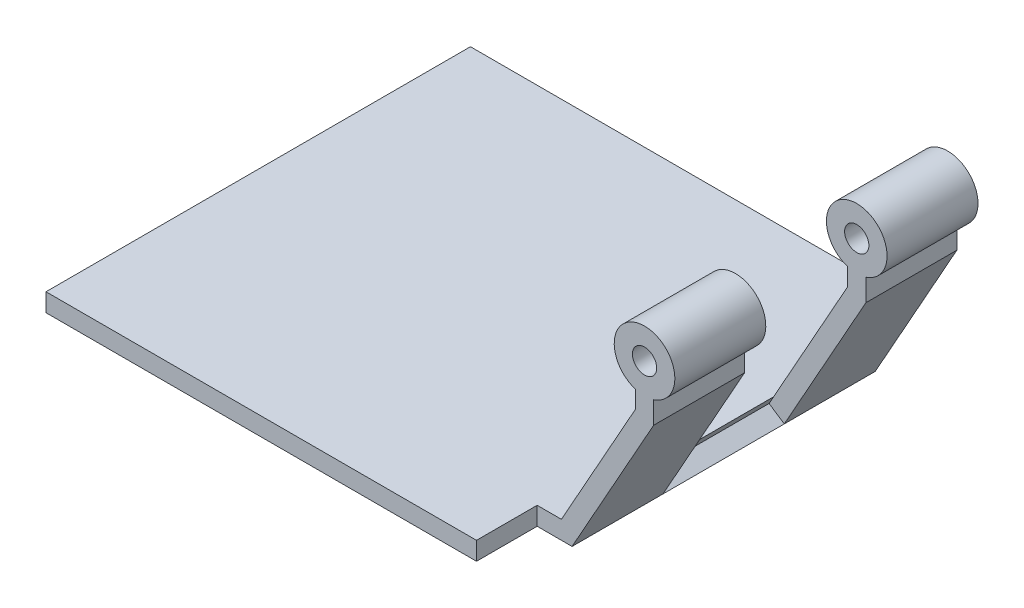
ISO-10303-21;
HEADER;
FILE_DESCRIPTION(('STEP AP214'),'2;1');
FILE_NAME('part.step','',(''),(''),'','','');
FILE_SCHEMA(('AUTOMOTIVE_DESIGN { 1 0 10303 214 1 1 1 1 }'));
ENDSEC;
DATA;
#1=APPLICATION_CONTEXT('core data for automotive mechanical design processes');
#2=APPLICATION_PROTOCOL_DEFINITION('international standard','automotive_design',2000,#1);
#3=PRODUCT_CONTEXT('',#1,'mechanical');
#4=PRODUCT('Part','Part','',(#3));
#5=PRODUCT_RELATED_PRODUCT_CATEGORY('part','',(#4));
#6=PRODUCT_DEFINITION_FORMATION('','',#4);
#7=PRODUCT_DEFINITION_CONTEXT('part definition',#1,'design');
#8=PRODUCT_DEFINITION('design','',#6,#7);
#9=PRODUCT_DEFINITION_SHAPE('','',#8);
#10=(LENGTH_UNIT() NAMED_UNIT(*) SI_UNIT(.MILLI.,.METRE.));
#11=(NAMED_UNIT(*) PLANE_ANGLE_UNIT() SI_UNIT($,.RADIAN.));
#12=(NAMED_UNIT(*) SI_UNIT($,.STERADIAN.) SOLID_ANGLE_UNIT());
#13=UNCERTAINTY_MEASURE_WITH_UNIT(LENGTH_MEASURE(1.E-05),#10,'distance_accuracy_value','');
#14=(GEOMETRIC_REPRESENTATION_CONTEXT(3) GLOBAL_UNCERTAINTY_ASSIGNED_CONTEXT((#13)) GLOBAL_UNIT_ASSIGNED_CONTEXT((#10,
#11,#12)) REPRESENTATION_CONTEXT('',''));
#15=CARTESIAN_POINT('',(0.,0.,0.));
#16=DIRECTION('',(0.,0.,1.));
#17=DIRECTION('',(1.,0.,0.));
#18=AXIS2_PLACEMENT_3D('',#15,#16,#17);
#19=CARTESIAN_POINT('',(93.710751130021,32.4608617941307,50.));
#20=DIRECTION('',(0.,0.,-1.));
#21=DIRECTION('',(-1.,0.,0.));
#22=AXIS2_PLACEMENT_3D('',#19,#20,#21);
#23=CYLINDRICAL_SURFACE('',#22,5.00000000000001);
#24=CARTESIAN_POINT('',(93.710751130021,32.4608617941307,15.));
#25=DIRECTION('',(0.,0.,1.));
#26=DIRECTION('',(0.,-1.,0.));
#27=AXIS2_PLACEMENT_3D('',#24,#25,#26);
#28=CIRCLE('',#27,5.00000000000001);
#29=CARTESIAN_POINT('',(95.210751130021,27.6911657870459,15.));
#30=VERTEX_POINT('',#29);
#31=CARTESIAN_POINT('',(92.210751130021,27.6911657870459,15.));
#32=VERTEX_POINT('',#31);
#33=EDGE_CURVE('E246',#30,#32,#28,.T.);
#34=ORIENTED_EDGE('',*,*,#33,.F.);
#35=DIRECTION('',(0.,0.,-1.));
#36=VECTOR('',#35,1.);
#37=CARTESIAN_POINT('',(95.210751130021,27.6911657870459,50.));
#38=LINE('',#37,#36);
#39=CARTESIAN_POINT('',(95.210751130021,27.6911657870459,0.));
#40=VERTEX_POINT('',#39);
#41=EDGE_CURVE('E335',#30,#40,#38,.T.);
#42=ORIENTED_EDGE('',*,*,#41,.T.);
#43=CARTESIAN_POINT('',(93.710751130021,32.4608617941307,0.));
#44=DIRECTION('',(0.,0.,1.));
#45=DIRECTION('',(1.,0.,0.));
#46=AXIS2_PLACEMENT_3D('',#43,#44,#45);
#47=CIRCLE('',#46,5.00000000000001);
#48=CARTESIAN_POINT('',(92.210751130021,27.6911657870459,0.));
#49=VERTEX_POINT('',#48);
#50=EDGE_CURVE('E276',#40,#49,#47,.T.);
#51=ORIENTED_EDGE('',*,*,#50,.T.);
#52=DIRECTION('',(0.,0.,-1.));
#53=VECTOR('',#52,1.);
#54=CARTESIAN_POINT('',(92.210751130021,27.6911657870459,50.));
#55=LINE('',#54,#53);
#56=EDGE_CURVE('E326',#32,#49,#55,.T.);
#57=ORIENTED_EDGE('',*,*,#56,.F.);
#58=EDGE_LOOP('',(#34,#42,#51,#57));
#59=FACE_BOUND('',#58,.T.);
#60=ADVANCED_FACE('F60',(#59),#23,.T.);
#61=CARTESIAN_POINT('',(93.710751130021,32.4608617941307,35.));
#62=DIRECTION('',(0.,0.,-1.));
#63=DIRECTION('',(0.,1.,0.));
#64=AXIS2_PLACEMENT_3D('',#61,#62,#63);
#65=CIRCLE('',#64,5.00000000000001);
#66=CARTESIAN_POINT('',(92.210751130021,27.6911657870459,35.));
#67=VERTEX_POINT('',#66);
#68=CARTESIAN_POINT('',(95.210751130021,27.6911657870459,35.));
#69=VERTEX_POINT('',#68);
#70=EDGE_CURVE('E260',#67,#69,#65,.T.);
#71=ORIENTED_EDGE('',*,*,#70,.F.);
#72=CARTESIAN_POINT('',(92.210751130021,27.6911657870459,50.));
#73=VERTEX_POINT('',#72);
#74=EDGE_CURVE('E332',#73,#67,#55,.T.);
#75=ORIENTED_EDGE('',*,*,#74,.F.);
#76=CARTESIAN_POINT('',(93.710751130021,32.4608617941307,50.));
#77=DIRECTION('',(0.,0.,1.));
#78=DIRECTION('',(1.,0.,0.));
#79=AXIS2_PLACEMENT_3D('',#76,#77,#78);
#80=CIRCLE('',#79,5.00000000000001);
#81=CARTESIAN_POINT('',(95.210751130021,27.6911657870459,50.));
#82=VERTEX_POINT('',#81);
#83=EDGE_CURVE('E297',#82,#73,#80,.T.);
#84=ORIENTED_EDGE('',*,*,#83,.F.);
#85=EDGE_CURVE('E336',#82,#69,#38,.T.);
#86=ORIENTED_EDGE('',*,*,#85,.T.);
#87=EDGE_LOOP('',(#71,#75,#84,#86));
#88=FACE_BOUND('',#87,.T.);
#89=ADVANCED_FACE('F420',(#88),#23,.T.);
#90=CARTESIAN_POINT('',(110.015744072677,30.0086373562634,35.));
#91=DIRECTION('',(0.,0.,-1.));
#92=DIRECTION('',(0.,1.,0.));
#93=AXIS2_PLACEMENT_3D('',#90,#91,#92);
#94=PLANE('',#93);
#95=CARTESIAN_POINT('',(93.710751130021,32.4608617941307,35.));
#96=DIRECTION('',(0.,0.,-1.));
#97=DIRECTION('',(0.,1.,0.));
#98=AXIS2_PLACEMENT_3D('',#95,#96,#97);
#99=CIRCLE('',#98,2.);
#100=CARTESIAN_POINT('',(93.710751130021,34.4608617941307,35.));
#101=VERTEX_POINT('',#100);
#102=EDGE_CURVE('E259',#101,#101,#99,.T.);
#103=ORIENTED_EDGE('',*,*,#102,.F.);
#104=EDGE_LOOP('',(#103));
#105=FACE_BOUND('',#104,.T.);
#106=DIRECTION('',(-0.488430045200838,-0.872603054627422,0.));
#107=VECTOR('',#106,1.);
#108=CARTESIAN_POINT('',(81.7587720513456,0.,35.));
#109=LINE('',#108,#107);
#110=CARTESIAN_POINT('',(95.210751130021,24.0325879830133,35.));
#111=VERTEX_POINT('',#110);
#112=CARTESIAN_POINT('',(81.7587720513456,0.,35.));
#113=VERTEX_POINT('',#112);
#114=EDGE_CURVE('E269',#111,#113,#109,.T.);
#115=ORIENTED_EDGE('',*,*,#114,.T.);
#116=DIRECTION('',(-0.832448886838119,0.554101841543571,0.));
#117=VECTOR('',#116,1.);
#118=CARTESIAN_POINT('',(87.4982105106161,-3.82033476167799,35.));
#119=LINE('',#118,#117);
#120=CARTESIAN_POINT('',(79.2540048400972,1.66724485591219,35.));
#121=VERTEX_POINT('',#120);
#122=EDGE_CURVE('E242',#113,#121,#119,.T.);
#123=ORIENTED_EDGE('',*,*,#122,.T.);
#124=DIRECTION('',(0.488430045200842,0.87260305462742,0.));
#125=VECTOR('',#124,1.);
#126=CARTESIAN_POINT('',(98.6719043625206,36.3582279438743,35.));
#127=LINE('',#126,#125);
#128=CARTESIAN_POINT('',(80.,3.,35.));
#129=VERTEX_POINT('',#128);
#130=EDGE_CURVE('E239',#121,#129,#127,.T.);
#131=ORIENTED_EDGE('',*,*,#130,.T.);
#132=DIRECTION('',(0.488430045200838,0.872603054627422,0.));
#133=VECTOR('',#132,1.);
#134=CARTESIAN_POINT('',(92.210751130021,24.8150763656856,35.));
#135=LINE('',#134,#133);
#136=CARTESIAN_POINT('',(92.210751130021,24.8150763656856,35.));
#137=VERTEX_POINT('',#136);
#138=EDGE_CURVE('E263',#129,#137,#135,.T.);
#139=ORIENTED_EDGE('',*,*,#138,.T.);
#140=DIRECTION('',(0.,-1.,0.));
#141=VECTOR('',#140,1.);
#142=CARTESIAN_POINT('',(92.210751130021,24.8150763656856,35.));
#143=LINE('',#142,#141);
#144=EDGE_CURVE('E264',#67,#137,#143,.T.);
#145=ORIENTED_EDGE('',*,*,#144,.F.);
#146=ORIENTED_EDGE('',*,*,#70,.T.);
#147=DIRECTION('',(0.,-1.,0.));
#148=VECTOR('',#147,1.);
#149=CARTESIAN_POINT('',(95.210751130021,24.0325879830133,35.));
#150=LINE('',#149,#148);
#151=EDGE_CURVE('E262',#69,#111,#150,.T.);
#152=ORIENTED_EDGE('',*,*,#151,.T.);
#153=EDGE_LOOP('',(#115,#123,#131,#139,#145,#146,#152));
#154=FACE_BOUND('',#153,.T.);
#155=ADVANCED_FACE('F366',(#105,#154),#94,.T.);
#156=CARTESIAN_POINT('',(110.015744072677,30.0086373562634,15.));
#157=DIRECTION('',(0.,0.,1.));
#158=DIRECTION('',(0.,-1.,0.));
#159=AXIS2_PLACEMENT_3D('',#156,#157,#158);
#160=PLANE('',#159);
#161=CARTESIAN_POINT('',(93.710751130021,32.4608617941307,15.));
#162=DIRECTION('',(0.,0.,1.));
#163=DIRECTION('',(0.,-1.,0.));
#164=AXIS2_PLACEMENT_3D('',#161,#162,#163);
#165=CIRCLE('',#164,2.);
#166=CARTESIAN_POINT('',(93.710751130021,30.4608617941307,15.));
#167=VERTEX_POINT('',#166);
#168=EDGE_CURVE('E245',#167,#167,#165,.T.);
#169=ORIENTED_EDGE('',*,*,#168,.F.);
#170=EDGE_LOOP('',(#169));
#171=FACE_BOUND('',#170,.T.);
#172=DIRECTION('',(-0.488430045200842,-0.87260305462742,0.));
#173=VECTOR('',#172,1.);
#174=CARTESIAN_POINT('',(98.6719043625206,36.3582279438743,15.));
#175=LINE('',#174,#173);
#176=CARTESIAN_POINT('',(80.,3.,15.));
#177=VERTEX_POINT('',#176);
#178=CARTESIAN_POINT('',(79.2540048400972,1.66724485591219,15.));
#179=VERTEX_POINT('',#178);
#180=EDGE_CURVE('E339',#177,#179,#175,.T.);
#181=ORIENTED_EDGE('',*,*,#180,.T.);
#182=DIRECTION('',(0.832448886838119,-0.554101841543571,0.));
#183=VECTOR('',#182,1.);
#184=CARTESIAN_POINT('',(87.4982105106161,-3.82033476167799,15.));
#185=LINE('',#184,#183);
#186=CARTESIAN_POINT('',(81.7587720513456,0.,15.));
#187=VERTEX_POINT('',#186);
#188=EDGE_CURVE('E67',#179,#187,#185,.T.);
#189=ORIENTED_EDGE('',*,*,#188,.T.);
#190=DIRECTION('',(0.488430045200838,0.872603054627422,0.));
#191=VECTOR('',#190,1.);
#192=CARTESIAN_POINT('',(81.7587720513456,0.,15.));
#193=LINE('',#192,#191);
#194=CARTESIAN_POINT('',(95.210751130021,24.0325879830133,15.));
#195=VERTEX_POINT('',#194);
#196=EDGE_CURVE('E249',#187,#195,#193,.T.);
#197=ORIENTED_EDGE('',*,*,#196,.T.);
#198=DIRECTION('',(0.,1.,0.));
#199=VECTOR('',#198,1.);
#200=CARTESIAN_POINT('',(95.210751130021,24.0325879830133,15.));
#201=LINE('',#200,#199);
#202=EDGE_CURVE('E250',#195,#30,#201,.T.);
#203=ORIENTED_EDGE('',*,*,#202,.T.);
#204=ORIENTED_EDGE('',*,*,#33,.T.);
#205=DIRECTION('',(0.,1.,0.));
#206=VECTOR('',#205,1.);
#207=CARTESIAN_POINT('',(92.210751130021,24.8150763656856,15.));
#208=LINE('',#207,#206);
#209=CARTESIAN_POINT('',(92.210751130021,24.8150763656856,15.));
#210=VERTEX_POINT('',#209);
#211=EDGE_CURVE('E248',#210,#32,#208,.T.);
#212=ORIENTED_EDGE('',*,*,#211,.F.);
#213=DIRECTION('',(-0.488430045200838,-0.872603054627422,0.));
#214=VECTOR('',#213,1.);
#215=CARTESIAN_POINT('',(92.210751130021,24.8150763656856,15.));
#216=LINE('',#215,#214);
#217=EDGE_CURVE('E256',#210,#177,#216,.T.);
#218=ORIENTED_EDGE('',*,*,#217,.T.);
#219=EDGE_LOOP('',(#181,#189,#197,#203,#204,#212,#218));
#220=FACE_BOUND('',#219,.T.);
#221=ADVANCED_FACE('F349',(#171,#220),#160,.T.);
#222=CARTESIAN_POINT('',(92.210751130021,24.8150763656856,50.));
#223=DIRECTION('',(-1.,0.,0.));
#224=DIRECTION('',(0.,0.,1.));
#225=AXIS2_PLACEMENT_3D('',#222,#223,#224);
#226=PLANE('',#225);
#227=ORIENTED_EDGE('',*,*,#74,.T.);
#228=ORIENTED_EDGE('',*,*,#144,.T.);
#229=DIRECTION('',(0.,0.,-1.));
#230=VECTOR('',#229,1.);
#231=CARTESIAN_POINT('',(92.210751130021,24.8150763656856,50.));
#232=LINE('',#231,#230);
#233=CARTESIAN_POINT('',(92.210751130021,24.8150763656856,50.));
#234=VERTEX_POINT('',#233);
#235=EDGE_CURVE('E315',#234,#137,#232,.T.);
#236=ORIENTED_EDGE('',*,*,#235,.F.);
#237=DIRECTION('',(0.,1.,0.));
#238=VECTOR('',#237,1.);
#239=CARTESIAN_POINT('',(92.210751130021,24.8150763656856,50.));
#240=LINE('',#239,#238);
#241=EDGE_CURVE('E287',#234,#73,#240,.T.);
#242=ORIENTED_EDGE('',*,*,#241,.T.);
#243=EDGE_LOOP('',(#227,#228,#236,#242));
#244=FACE_BOUND('',#243,.T.);
#245=ADVANCED_FACE('F418',(#244),#226,.T.);
#246=CARTESIAN_POINT('',(92.210751130021,24.8150763656856,0.));
#247=VERTEX_POINT('',#246);
#248=EDGE_CURVE('E314',#210,#247,#232,.T.);
#249=ORIENTED_EDGE('',*,*,#248,.F.);
#250=ORIENTED_EDGE('',*,*,#211,.T.);
#251=ORIENTED_EDGE('',*,*,#56,.T.);
#252=DIRECTION('',(0.,1.,0.));
#253=VECTOR('',#252,1.);
#254=CARTESIAN_POINT('',(92.210751130021,24.8150763656856,0.));
#255=LINE('',#254,#253);
#256=EDGE_CURVE('E303',#247,#49,#255,.T.);
#257=ORIENTED_EDGE('',*,*,#256,.F.);
#258=EDGE_LOOP('',(#249,#250,#251,#257));
#259=FACE_BOUND('',#258,.T.);
#260=ADVANCED_FACE('F403',(#259),#226,.T.);
#261=CARTESIAN_POINT('',(92.210751130021,24.8150763656856,50.));
#262=DIRECTION('',(0.872603054627422,-0.488430045200838,0.));
#263=DIRECTION('',(0.488430045200838,0.872603054627422,0.));
#264=AXIS2_PLACEMENT_3D('',#261,#262,#263);
#265=PLANE('',#264);
#266=ORIENTED_EDGE('',*,*,#138,.F.);
#267=DIRECTION('',(0.,0.,-1.));
#268=VECTOR('',#267,1.);
#269=CARTESIAN_POINT('',(80.,3.,50.));
#270=LINE('',#269,#268);
#271=CARTESIAN_POINT('',(80.,3.,50.));
#272=VERTEX_POINT('',#271);
#273=EDGE_CURVE('E311',#272,#129,#270,.T.);
#274=ORIENTED_EDGE('',*,*,#273,.F.);
#275=DIRECTION('',(-0.488430045200838,-0.872603054627422,0.));
#276=VECTOR('',#275,1.);
#277=CARTESIAN_POINT('',(92.210751130021,24.8150763656856,50.));
#278=LINE('',#277,#276);
#279=EDGE_CURVE('E290',#234,#272,#278,.T.);
#280=ORIENTED_EDGE('',*,*,#279,.F.);
#281=ORIENTED_EDGE('',*,*,#235,.T.);
#282=EDGE_LOOP('',(#266,#274,#280,#281));
#283=FACE_BOUND('',#282,.T.);
#284=ADVANCED_FACE('F415',(#283),#265,.F.);
#285=ORIENTED_EDGE('',*,*,#217,.F.);
#286=ORIENTED_EDGE('',*,*,#248,.T.);
#287=DIRECTION('',(-0.488430045200838,-0.872603054627422,0.));
#288=VECTOR('',#287,1.);
#289=CARTESIAN_POINT('',(92.210751130021,24.8150763656856,0.));
#290=LINE('',#289,#288);
#291=CARTESIAN_POINT('',(80.,3.,0.));
#292=VERTEX_POINT('',#291);
#293=EDGE_CURVE('E306',#247,#292,#290,.T.);
#294=ORIENTED_EDGE('',*,*,#293,.T.);
#295=EDGE_CURVE('E293',#177,#292,#270,.T.);
#296=ORIENTED_EDGE('',*,*,#295,.F.);
#297=EDGE_LOOP('',(#285,#286,#294,#296));
#298=FACE_BOUND('',#297,.T.);
#299=ADVANCED_FACE('F408',(#298),#265,.F.);
#300=CARTESIAN_POINT('',(80.,3.,50.));
#301=DIRECTION('',(0.,-1.,0.));
#302=DIRECTION('',(1.,0.,0.));
#303=AXIS2_PLACEMENT_3D('',#300,#301,#302);
#304=PLANE('',#303);
#305=DIRECTION('',(-1.,0.,0.));
#306=VECTOR('',#305,1.);
#307=CARTESIAN_POINT('',(80.,3.,0.));
#308=LINE('',#307,#306);
#309=CARTESIAN_POINT('',(76.,3.,0.));
#310=VERTEX_POINT('',#309);
#311=EDGE_CURVE('E282',#292,#310,#308,.T.);
#312=ORIENTED_EDGE('',*,*,#311,.T.);
#313=DIRECTION('',(0.,0.,-1.));
#314=VECTOR('',#313,1.);
#315=CARTESIAN_POINT('',(76.,3.,-10.));
#316=LINE('',#315,#314);
#317=CARTESIAN_POINT('',(76.,3.,-10.));
#318=VERTEX_POINT('',#317);
#319=EDGE_CURVE('E223',#310,#318,#316,.T.);
#320=ORIENTED_EDGE('',*,*,#319,.T.);
#321=DIRECTION('',(-1.,0.,0.));
#322=VECTOR('',#321,1.);
#323=CARTESIAN_POINT('',(5.,2.99999999999999,-10.));
#324=LINE('',#323,#322);
#325=CARTESIAN_POINT('',(5.,2.99999999999999,-10.));
#326=VERTEX_POINT('',#325);
#327=EDGE_CURVE('E214',#318,#326,#324,.T.);
#328=ORIENTED_EDGE('',*,*,#327,.T.);
#329=DIRECTION('',(0.,0.,1.));
#330=VECTOR('',#329,1.);
#331=CARTESIAN_POINT('',(5.,2.99999999999999,-500000.));
#332=LINE('',#331,#330);
#333=CARTESIAN_POINT('',(5.00000000000001,2.99999999999999,60.));
#334=VERTEX_POINT('',#333);
#335=EDGE_CURVE('E197',#326,#334,#332,.T.);
#336=ORIENTED_EDGE('',*,*,#335,.T.);
#337=DIRECTION('',(1.,0.,0.));
#338=VECTOR('',#337,1.);
#339=CARTESIAN_POINT('',(5.00000000000001,2.99999999999999,60.));
#340=LINE('',#339,#338);
#341=CARTESIAN_POINT('',(76.,3.,60.));
#342=VERTEX_POINT('',#341);
#343=EDGE_CURVE('E205',#334,#342,#340,.T.);
#344=ORIENTED_EDGE('',*,*,#343,.T.);
#345=CARTESIAN_POINT('',(76.,3.,50.));
#346=VERTEX_POINT('',#345);
#347=EDGE_CURVE('E218',#342,#346,#316,.T.);
#348=ORIENTED_EDGE('',*,*,#347,.T.);
#349=DIRECTION('',(-1.,0.,0.));
#350=VECTOR('',#349,1.);
#351=CARTESIAN_POINT('',(80.,3.,50.));
#352=LINE('',#351,#350);
#353=EDGE_CURVE('E74',#272,#346,#352,.T.);
#354=ORIENTED_EDGE('',*,*,#353,.F.);
#355=ORIENTED_EDGE('',*,*,#273,.T.);
#356=DIRECTION('',(0.,0.,-1.));
#357=VECTOR('',#356,1.);
#358=CARTESIAN_POINT('',(80.,3.,50.));
#359=LINE('',#358,#357);
#360=EDGE_CURVE('E234',#129,#177,#359,.T.);
#361=ORIENTED_EDGE('',*,*,#360,.T.);
#362=ORIENTED_EDGE('',*,*,#295,.T.);
#363=EDGE_LOOP('',(#312,#320,#328,#336,#344,#348,#354,#355,#361,#362));
#364=FACE_BOUND('',#363,.T.);
#365=ADVANCED_FACE('F383',(#364),#304,.F.);
#366=CARTESIAN_POINT('',(81.7587720513456,0.,50.));
#367=DIRECTION('',(-0.872603054627422,0.488430045200838,0.));
#368=DIRECTION('',(-0.488430045200838,-0.872603054627422,0.));
#369=AXIS2_PLACEMENT_3D('',#366,#367,#368);
#370=PLANE('',#369);
#371=ORIENTED_EDGE('',*,*,#114,.F.);
#372=DIRECTION('',(0.,0.,-1.));
#373=VECTOR('',#372,1.);
#374=CARTESIAN_POINT('',(95.210751130021,24.0325879830133,50.));
#375=LINE('',#374,#373);
#376=CARTESIAN_POINT('',(95.210751130021,24.0325879830133,50.));
#377=VERTEX_POINT('',#376);
#378=EDGE_CURVE('E319',#377,#111,#375,.T.);
#379=ORIENTED_EDGE('',*,*,#378,.F.);
#380=DIRECTION('',(0.488430045200838,0.872603054627422,0.));
#381=VECTOR('',#380,1.);
#382=CARTESIAN_POINT('',(81.7587720513456,0.,50.));
#383=LINE('',#382,#381);
#384=CARTESIAN_POINT('',(81.7587720513456,0.,50.));
#385=VERTEX_POINT('',#384);
#386=EDGE_CURVE('E281',#385,#377,#383,.T.);
#387=ORIENTED_EDGE('',*,*,#386,.F.);
#388=DIRECTION('',(0.,0.,-1.));
#389=VECTOR('',#388,1.);
#390=CARTESIAN_POINT('',(81.7587720513456,0.,50.));
#391=LINE('',#390,#389);
#392=EDGE_CURVE('E323',#385,#113,#391,.T.);
#393=ORIENTED_EDGE('',*,*,#392,.T.);
#394=EDGE_LOOP('',(#371,#379,#387,#393));
#395=FACE_BOUND('',#394,.T.);
#396=ADVANCED_FACE('F370',(#395),#370,.F.);
#397=ORIENTED_EDGE('',*,*,#196,.F.);
#398=CARTESIAN_POINT('',(81.7587720513456,0.,0.));
#399=VERTEX_POINT('',#398);
#400=EDGE_CURVE('E322',#187,#399,#391,.T.);
#401=ORIENTED_EDGE('',*,*,#400,.T.);
#402=DIRECTION('',(0.488430045200838,0.872603054627422,0.));
#403=VECTOR('',#402,1.);
#404=CARTESIAN_POINT('',(81.7587720513456,0.,0.));
#405=LINE('',#404,#403);
#406=CARTESIAN_POINT('',(95.210751130021,24.0325879830133,0.));
#407=VERTEX_POINT('',#406);
#408=EDGE_CURVE('E296',#399,#407,#405,.T.);
#409=ORIENTED_EDGE('',*,*,#408,.T.);
#410=EDGE_CURVE('E318',#195,#407,#375,.T.);
#411=ORIENTED_EDGE('',*,*,#410,.F.);
#412=EDGE_LOOP('',(#397,#401,#409,#411));
#413=FACE_BOUND('',#412,.T.);
#414=ADVANCED_FACE('F357',(#413),#370,.F.);
#415=CARTESIAN_POINT('',(95.210751130021,24.0325879830133,50.));
#416=DIRECTION('',(-1.,0.,0.));
#417=DIRECTION('',(0.,0.,1.));
#418=AXIS2_PLACEMENT_3D('',#415,#416,#417);
#419=PLANE('',#418);
#420=ORIENTED_EDGE('',*,*,#151,.F.);
#421=ORIENTED_EDGE('',*,*,#85,.F.);
#422=DIRECTION('',(0.,1.,0.));
#423=VECTOR('',#422,1.);
#424=CARTESIAN_POINT('',(95.210751130021,24.0325879830133,50.));
#425=LINE('',#424,#423);
#426=EDGE_CURVE('E284',#377,#82,#425,.T.);
#427=ORIENTED_EDGE('',*,*,#426,.F.);
#428=ORIENTED_EDGE('',*,*,#378,.T.);
#429=EDGE_LOOP('',(#420,#421,#427,#428));
#430=FACE_BOUND('',#429,.T.);
#431=ADVANCED_FACE('F374',(#430),#419,.F.);
#432=ORIENTED_EDGE('',*,*,#202,.F.);
#433=ORIENTED_EDGE('',*,*,#410,.T.);
#434=DIRECTION('',(0.,1.,0.));
#435=VECTOR('',#434,1.);
#436=CARTESIAN_POINT('',(95.210751130021,24.0325879830133,0.));
#437=LINE('',#436,#435);
#438=EDGE_CURVE('E300',#407,#40,#437,.T.);
#439=ORIENTED_EDGE('',*,*,#438,.T.);
#440=ORIENTED_EDGE('',*,*,#41,.F.);
#441=EDGE_LOOP('',(#432,#433,#439,#440));
#442=FACE_BOUND('',#441,.T.);
#443=ADVANCED_FACE('F397',(#442),#419,.F.);
#444=CARTESIAN_POINT('',(93.710751130021,32.4608617941307,50.));
#445=DIRECTION('',(0.,0.,-1.));
#446=DIRECTION('',(-1.,0.,0.));
#447=AXIS2_PLACEMENT_3D('',#444,#445,#446);
#448=CYLINDRICAL_SURFACE('',#447,2.);
#449=CARTESIAN_POINT('',(93.710751130021,32.4608617941307,50.));
#450=DIRECTION('',(0.,0.,1.));
#451=DIRECTION('',(1.,0.,0.));
#452=AXIS2_PLACEMENT_3D('',#449,#450,#451);
#453=CIRCLE('',#452,2.);
#454=CARTESIAN_POINT('',(95.710751130021,32.4608617941307,50.));
#455=VERTEX_POINT('',#454);
#456=EDGE_CURVE('E273',#455,#455,#453,.T.);
#457=ORIENTED_EDGE('',*,*,#456,.T.);
#458=EDGE_LOOP('',(#457));
#459=FACE_BOUND('',#458,.T.);
#460=ORIENTED_EDGE('',*,*,#102,.T.);
#461=EDGE_LOOP('',(#460));
#462=FACE_BOUND('',#461,.T.);
#463=ADVANCED_FACE('F544',(#459,#462),#448,.F.);
#464=CARTESIAN_POINT('',(93.710751130021,32.4608617941307,0.));
#465=DIRECTION('',(0.,0.,1.));
#466=DIRECTION('',(1.,0.,0.));
#467=AXIS2_PLACEMENT_3D('',#464,#465,#466);
#468=CIRCLE('',#467,2.);
#469=CARTESIAN_POINT('',(95.710751130021,32.4608617941307,0.));
#470=VERTEX_POINT('',#469);
#471=EDGE_CURVE('E272',#470,#470,#468,.T.);
#472=ORIENTED_EDGE('',*,*,#471,.F.);
#473=EDGE_LOOP('',(#472));
#474=FACE_BOUND('',#473,.T.);
#475=ORIENTED_EDGE('',*,*,#168,.T.);
#476=EDGE_LOOP('',(#475));
#477=FACE_BOUND('',#476,.T.);
#478=ADVANCED_FACE('F478',(#474,#477),#448,.F.);
#479=CARTESIAN_POINT('',(0.,0.,50.));
#480=DIRECTION('',(0.,1.,0.));
#481=DIRECTION('',(0.,0.,1.));
#482=AXIS2_PLACEMENT_3D('',#479,#480,#481);
#483=PLANE('',#482);
#484=DIRECTION('',(1.,0.,0.));
#485=VECTOR('',#484,1.);
#486=CARTESIAN_POINT('',(0.,0.,50.));
#487=LINE('',#486,#485);
#488=CARTESIAN_POINT('',(76.,0.,50.));
#489=VERTEX_POINT('',#488);
#490=EDGE_CURVE('E279',#489,#385,#487,.T.);
#491=ORIENTED_EDGE('',*,*,#490,.F.);
#492=DIRECTION('',(0.,0.,-1.));
#493=VECTOR('',#492,1.);
#494=CARTESIAN_POINT('',(76.,0.,-10.));
#495=LINE('',#494,#493);
#496=CARTESIAN_POINT('',(76.,0.,60.));
#497=VERTEX_POINT('',#496);
#498=EDGE_CURVE('E212',#497,#489,#495,.T.);
#499=ORIENTED_EDGE('',*,*,#498,.F.);
#500=DIRECTION('',(1.,0.,0.));
#501=VECTOR('',#500,1.);
#502=CARTESIAN_POINT('',(5.00000000000001,0.,60.));
#503=LINE('',#502,#501);
#504=CARTESIAN_POINT('',(5.00000000000001,0.,60.));
#505=VERTEX_POINT('',#504);
#506=EDGE_CURVE('E203',#505,#497,#503,.T.);
#507=ORIENTED_EDGE('',*,*,#506,.F.);
#508=DIRECTION('',(0.,0.,1.));
#509=VECTOR('',#508,1.);
#510=CARTESIAN_POINT('',(5.,0.,-500000.));
#511=LINE('',#510,#509);
#512=CARTESIAN_POINT('',(5.,0.,-10.));
#513=VERTEX_POINT('',#512);
#514=EDGE_CURVE('E186',#513,#505,#511,.T.);
#515=ORIENTED_EDGE('',*,*,#514,.F.);
#516=DIRECTION('',(-1.,0.,0.));
#517=VECTOR('',#516,1.);
#518=CARTESIAN_POINT('',(5.,0.,-10.));
#519=LINE('',#518,#517);
#520=CARTESIAN_POINT('',(76.,0.,-10.));
#521=VERTEX_POINT('',#520);
#522=EDGE_CURVE('E207',#521,#513,#519,.T.);
#523=ORIENTED_EDGE('',*,*,#522,.F.);
#524=CARTESIAN_POINT('',(76.,0.,0.));
#525=VERTEX_POINT('',#524);
#526=EDGE_CURVE('E213',#525,#521,#495,.T.);
#527=ORIENTED_EDGE('',*,*,#526,.F.);
#528=DIRECTION('',(1.,0.,0.));
#529=VECTOR('',#528,1.);
#530=CARTESIAN_POINT('',(0.,0.,0.));
#531=LINE('',#530,#529);
#532=EDGE_CURVE('E294',#525,#399,#531,.T.);
#533=ORIENTED_EDGE('',*,*,#532,.T.);
#534=ORIENTED_EDGE('',*,*,#400,.F.);
#535=EDGE_CURVE('E327',#113,#187,#391,.T.);
#536=ORIENTED_EDGE('',*,*,#535,.F.);
#537=ORIENTED_EDGE('',*,*,#392,.F.);
#538=EDGE_LOOP('',(#491,#499,#507,#515,#523,#527,#533,#534,#536,#537));
#539=FACE_BOUND('',#538,.T.);
#540=ADVANCED_FACE('F210',(#539),#483,.F.);
#541=CARTESIAN_POINT('',(0.,0.,0.));
#542=DIRECTION('',(0.,0.,1.));
#543=DIRECTION('',(1.,0.,0.));
#544=AXIS2_PLACEMENT_3D('',#541,#542,#543);
#545=PLANE('',#544);
#546=ORIENTED_EDGE('',*,*,#532,.F.);
#547=DIRECTION('',(0.,1.,0.));
#548=VECTOR('',#547,1.);
#549=CARTESIAN_POINT('',(76.,0.,0.));
#550=LINE('',#549,#548);
#551=EDGE_CURVE('E198',#525,#310,#550,.T.);
#552=ORIENTED_EDGE('',*,*,#551,.T.);
#553=ORIENTED_EDGE('',*,*,#311,.F.);
#554=ORIENTED_EDGE('',*,*,#293,.F.);
#555=ORIENTED_EDGE('',*,*,#256,.T.);
#556=ORIENTED_EDGE('',*,*,#50,.F.);
#557=ORIENTED_EDGE('',*,*,#438,.F.);
#558=ORIENTED_EDGE('',*,*,#408,.F.);
#559=EDGE_LOOP('',(#546,#552,#553,#554,#555,#556,#557,#558));
#560=FACE_BOUND('',#559,.T.);
#561=ORIENTED_EDGE('',*,*,#471,.T.);
#562=EDGE_LOOP('',(#561));
#563=FACE_BOUND('',#562,.T.);
#564=ADVANCED_FACE('F390',(#560,#563),#545,.F.);
#565=CARTESIAN_POINT('',(0.,0.,50.));
#566=DIRECTION('',(0.,0.,1.));
#567=DIRECTION('',(1.,0.,0.));
#568=AXIS2_PLACEMENT_3D('',#565,#566,#567);
#569=PLANE('',#568);
#570=DIRECTION('',(0.,1.,0.));
#571=VECTOR('',#570,1.);
#572=CARTESIAN_POINT('',(76.,0.,50.));
#573=LINE('',#572,#571);
#574=EDGE_CURVE('E12',#489,#346,#573,.T.);
#575=ORIENTED_EDGE('',*,*,#574,.F.);
#576=ORIENTED_EDGE('',*,*,#490,.T.);
#577=ORIENTED_EDGE('',*,*,#386,.T.);
#578=ORIENTED_EDGE('',*,*,#426,.T.);
#579=ORIENTED_EDGE('',*,*,#83,.T.);
#580=ORIENTED_EDGE('',*,*,#241,.F.);
#581=ORIENTED_EDGE('',*,*,#279,.T.);
#582=ORIENTED_EDGE('',*,*,#353,.T.);
#583=EDGE_LOOP('',(#575,#576,#577,#578,#579,#580,#581,#582));
#584=FACE_BOUND('',#583,.T.);
#585=ORIENTED_EDGE('',*,*,#456,.F.);
#586=EDGE_LOOP('',(#585));
#587=FACE_BOUND('',#586,.T.);
#588=ADVANCED_FACE('F376',(#584,#587),#569,.T.);
#589=CARTESIAN_POINT('',(81.7587720513456,0.,50.));
#590=DIRECTION('',(-0.554101841543571,-0.832448886838119,0.));
#591=DIRECTION('',(0.832448886838119,-0.554101841543571,0.));
#592=AXIS2_PLACEMENT_3D('',#589,#590,#591);
#593=PLANE('',#592);
#594=ORIENTED_EDGE('',*,*,#122,.F.);
#595=ORIENTED_EDGE('',*,*,#535,.T.);
#596=ORIENTED_EDGE('',*,*,#188,.F.);
#597=DIRECTION('',(0.,0.,-1.));
#598=VECTOR('',#597,1.);
#599=CARTESIAN_POINT('',(79.2540048400972,1.66724485591219,50.));
#600=LINE('',#599,#598);
#601=EDGE_CURVE('E237',#121,#179,#600,.T.);
#602=ORIENTED_EDGE('',*,*,#601,.F.);
#603=EDGE_LOOP('',(#594,#595,#596,#602));
#604=FACE_BOUND('',#603,.T.);
#605=ADVANCED_FACE('F363',(#604),#593,.F.);
#606=CARTESIAN_POINT('',(79.2540048400972,1.66724485591219,50.));
#607=DIRECTION('',(-0.872603054627419,0.488430045200842,0.));
#608=DIRECTION('',(-0.488430045200842,-0.87260305462742,0.));
#609=AXIS2_PLACEMENT_3D('',#606,#607,#608);
#610=PLANE('',#609);
#611=ORIENTED_EDGE('',*,*,#130,.F.);
#612=ORIENTED_EDGE('',*,*,#601,.T.);
#613=ORIENTED_EDGE('',*,*,#180,.F.);
#614=ORIENTED_EDGE('',*,*,#360,.F.);
#615=EDGE_LOOP('',(#611,#612,#613,#614));
#616=FACE_BOUND('',#615,.T.);
#617=ADVANCED_FACE('F411',(#616),#610,.F.);
#618=CARTESIAN_POINT('',(5.,0.,-500000.));
#619=DIRECTION('',(1.,0.,0.));
#620=DIRECTION('',(0.,1.,0.));
#621=AXIS2_PLACEMENT_3D('',#618,#619,#620);
#622=PLANE('',#621);
#623=ORIENTED_EDGE('',*,*,#335,.F.);
#624=DIRECTION('',(0.,1.,0.));
#625=VECTOR('',#624,1.);
#626=CARTESIAN_POINT('',(5.,0.,-10.));
#627=LINE('',#626,#625);
#628=EDGE_CURVE('E192',#513,#326,#627,.T.);
#629=ORIENTED_EDGE('',*,*,#628,.F.);
#630=ORIENTED_EDGE('',*,*,#514,.T.);
#631=DIRECTION('',(0.,1.,0.));
#632=VECTOR('',#631,1.);
#633=CARTESIAN_POINT('',(5.00000000000001,0.,60.));
#634=LINE('',#633,#632);
#635=EDGE_CURVE('E189',#505,#334,#634,.T.);
#636=ORIENTED_EDGE('',*,*,#635,.T.);
#637=EDGE_LOOP('',(#623,#629,#630,#636));
#638=FACE_BOUND('',#637,.T.);
#639=ADVANCED_FACE('F188',(#638),#622,.F.);
#640=CARTESIAN_POINT('',(5.00000000000001,0.,60.));
#641=DIRECTION('',(0.,0.,1.));
#642=DIRECTION('',(1.,0.,0.));
#643=AXIS2_PLACEMENT_3D('',#640,#641,#642);
#644=PLANE('',#643);
#645=ORIENTED_EDGE('',*,*,#343,.F.);
#646=ORIENTED_EDGE('',*,*,#635,.F.);
#647=ORIENTED_EDGE('',*,*,#506,.T.);
#648=DIRECTION('',(0.,1.,0.));
#649=VECTOR('',#648,1.);
#650=CARTESIAN_POINT('',(76.,0.,60.));
#651=LINE('',#650,#649);
#652=EDGE_CURVE('E206',#497,#342,#651,.T.);
#653=ORIENTED_EDGE('',*,*,#652,.T.);
#654=EDGE_LOOP('',(#645,#646,#647,#653));
#655=FACE_BOUND('',#654,.T.);
#656=ADVANCED_FACE('F202',(#655),#644,.T.);
#657=CARTESIAN_POINT('',(76.,0.,-10.));
#658=DIRECTION('',(1.,0.,0.));
#659=DIRECTION('',(0.,0.,-1.));
#660=AXIS2_PLACEMENT_3D('',#657,#658,#659);
#661=PLANE('',#660);
#662=ORIENTED_EDGE('',*,*,#498,.T.);
#663=ORIENTED_EDGE('',*,*,#574,.T.);
#664=ORIENTED_EDGE('',*,*,#347,.F.);
#665=ORIENTED_EDGE('',*,*,#652,.F.);
#666=EDGE_LOOP('',(#662,#663,#664,#665));
#667=FACE_BOUND('',#666,.T.);
#668=ADVANCED_FACE('F380',(#667),#661,.T.);
#669=ORIENTED_EDGE('',*,*,#551,.F.);
#670=ORIENTED_EDGE('',*,*,#526,.T.);
#671=DIRECTION('',(0.,1.,0.));
#672=VECTOR('',#671,1.);
#673=CARTESIAN_POINT('',(76.,0.,-10.));
#674=LINE('',#673,#672);
#675=EDGE_CURVE('E227',#521,#318,#674,.T.);
#676=ORIENTED_EDGE('',*,*,#675,.T.);
#677=ORIENTED_EDGE('',*,*,#319,.F.);
#678=EDGE_LOOP('',(#669,#670,#676,#677));
#679=FACE_BOUND('',#678,.T.);
#680=ADVANCED_FACE('F522',(#679),#661,.T.);
#681=CARTESIAN_POINT('',(5.,0.,-10.));
#682=DIRECTION('',(0.,0.,-1.));
#683=DIRECTION('',(-1.,0.,0.));
#684=AXIS2_PLACEMENT_3D('',#681,#682,#683);
#685=PLANE('',#684);
#686=ORIENTED_EDGE('',*,*,#327,.F.);
#687=ORIENTED_EDGE('',*,*,#675,.F.);
#688=ORIENTED_EDGE('',*,*,#522,.T.);
#689=ORIENTED_EDGE('',*,*,#628,.T.);
#690=EDGE_LOOP('',(#686,#687,#688,#689));
#691=FACE_BOUND('',#690,.T.);
#692=ADVANCED_FACE('F386',(#691),#685,.T.);
#693=CLOSED_SHELL('',(#60,#89,#155,#221,#245,#260,#284,#299,#365,#396,#414,#431,#443,#463,#478,
#540,#564,#588,#605,#617,#639,#656,#668,#680,#692));
#694=MANIFOLD_SOLID_BREP('B2',#693);
#695=ADVANCED_BREP_SHAPE_REPRESENTATION('',(#18,#694),#14);
#696=SHAPE_DEFINITION_REPRESENTATION(#9,#695);
ENDSEC;
END-ISO-10303-21;
